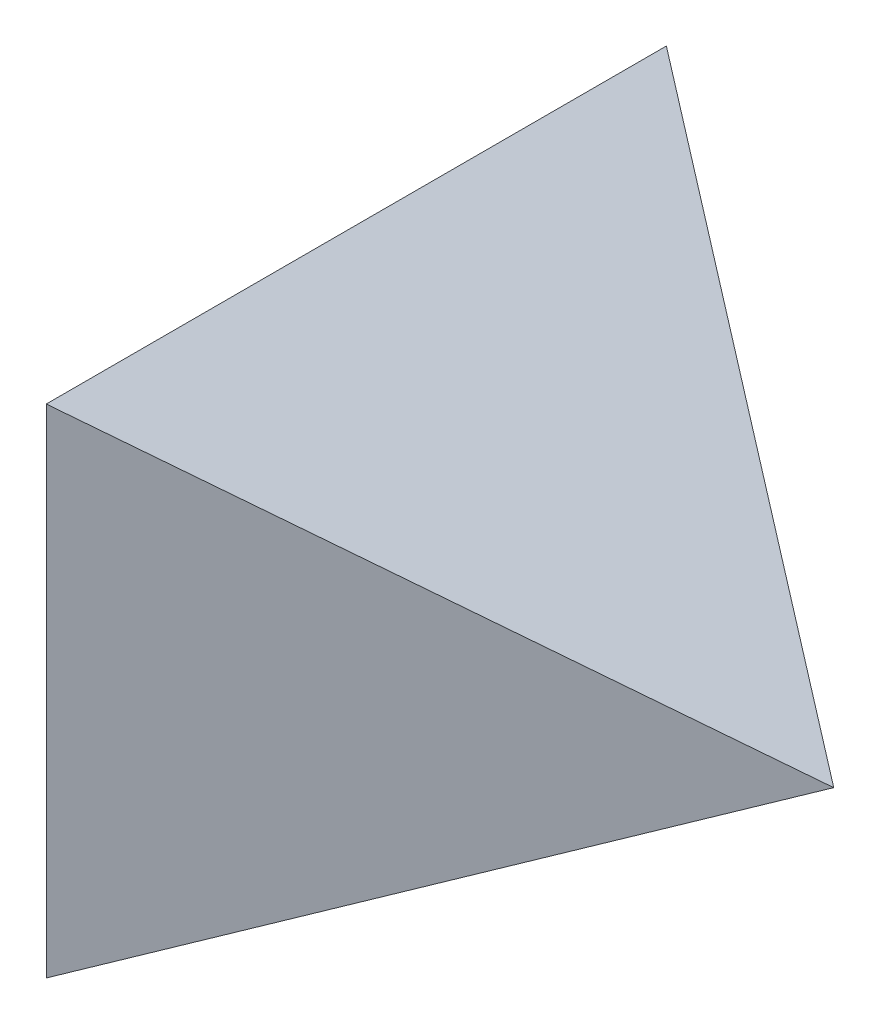
ISO-10303-21;
HEADER;
FILE_DESCRIPTION(('STEP AP214'),'2;1');
FILE_NAME('part.step','',(''),(''),'','','');
FILE_SCHEMA(('AUTOMOTIVE_DESIGN { 1 0 10303 214 1 1 1 1 }'));
ENDSEC;
DATA;
#1=APPLICATION_CONTEXT('core data for automotive mechanical design processes');
#2=APPLICATION_PROTOCOL_DEFINITION('international standard','automotive_design',2000,#1);
#3=PRODUCT_CONTEXT('',#1,'mechanical');
#4=PRODUCT('Part','Part','',(#3));
#5=PRODUCT_RELATED_PRODUCT_CATEGORY('part','',(#4));
#6=PRODUCT_DEFINITION_FORMATION('','',#4);
#7=PRODUCT_DEFINITION_CONTEXT('part definition',#1,'design');
#8=PRODUCT_DEFINITION('design','',#6,#7);
#9=PRODUCT_DEFINITION_SHAPE('','',#8);
#10=(LENGTH_UNIT() NAMED_UNIT(*) SI_UNIT(.MILLI.,.METRE.));
#11=(NAMED_UNIT(*) PLANE_ANGLE_UNIT() SI_UNIT($,.RADIAN.));
#12=(NAMED_UNIT(*) SI_UNIT($,.STERADIAN.) SOLID_ANGLE_UNIT());
#13=UNCERTAINTY_MEASURE_WITH_UNIT(LENGTH_MEASURE(1.E-05),#10,'distance_accuracy_value','');
#14=(GEOMETRIC_REPRESENTATION_CONTEXT(3) GLOBAL_UNCERTAINTY_ASSIGNED_CONTEXT((#13)) GLOBAL_UNIT_ASSIGNED_CONTEXT((#10,
#11,#12)) REPRESENTATION_CONTEXT('',''));
#15=CARTESIAN_POINT('',(0.,0.,0.));
#16=DIRECTION('',(0.,0.,1.));
#17=DIRECTION('',(1.,0.,0.));
#18=AXIS2_PLACEMENT_3D('',#15,#16,#17);
#19=CARTESIAN_POINT('',(0.,0.,-3000.));
#20=DIRECTION('',(0.461748613235035,-0.887010833178221,0.));
#21=DIRECTION('',(0.887010833178221,0.461748613235035,0.));
#22=AXIS2_PLACEMENT_3D('',#19,#20,#21);
#23=PLANE('',#22);
#24=DIRECTION('',(0.768612426799949,0.40011430403667,-0.49914274618985));
#25=VECTOR('',#24,1.);
#26=CARTESIAN_POINT('',(1150.94195240571,599.142457520112,-747.430443221833));
#27=LINE('',#26,#25);
#28=CARTESIAN_POINT('',(-3000.,-1561.70115165524,1948.22277959252));
#29=VERTEX_POINT('',#28);
#30=CARTESIAN_POINT('',(1.11022302462516E-13,2.22044604925031E-13,0.));
#31=VERTEX_POINT('',#30);
#32=EDGE_CURVE('E53',#29,#31,#27,.T.);
#33=ORIENTED_EDGE('',*,*,#32,.F.);
#34=DIRECTION('',(0.,0.,1.));
#35=VECTOR('',#34,1.);
#36=CARTESIAN_POINT('',(-3000.,-1561.70115165524,-3000.));
#37=LINE('',#36,#35);
#38=CARTESIAN_POINT('',(-3000.,-1561.70115165524,-1948.22277959252));
#39=VERTEX_POINT('',#38);
#40=EDGE_CURVE('E72',#39,#29,#37,.T.);
#41=ORIENTED_EDGE('',*,*,#40,.F.);
#42=DIRECTION('',(-0.768612426799948,-0.40011430403667,-0.49914274618985));
#43=VECTOR('',#42,1.);
#44=CARTESIAN_POINT('',(-1150.94195240571,-599.142457520112,-747.430443221835));
#45=LINE('',#44,#43);
#46=EDGE_CURVE('E77',#31,#39,#45,.T.);
#47=ORIENTED_EDGE('',*,*,#46,.F.);
#48=EDGE_LOOP('',(#33,#41,#47));
#49=FACE_BOUND('',#48,.T.);
#50=ADVANCED_FACE('F32',(#49),#23,.T.);
#51=CARTESIAN_POINT('',(-3000.,1561.70115165524,-3000.));
#52=DIRECTION('',(-1.,0.,0.));
#53=DIRECTION('',(0.,0.,1.));
#54=AXIS2_PLACEMENT_3D('',#51,#52,#53);
#55=PLANE('',#54);
#56=DIRECTION('',(0.,-1.,0.));
#57=VECTOR('',#56,1.);
#58=CARTESIAN_POINT('',(-3000.,3000.,1948.22277959252));
#59=LINE('',#58,#57);
#60=CARTESIAN_POINT('',(-3000.,1561.70115165524,1948.22277959252));
#61=VERTEX_POINT('',#60);
#62=EDGE_CURVE('E62',#61,#29,#59,.T.);
#63=ORIENTED_EDGE('',*,*,#62,.F.);
#64=DIRECTION('',(0.,0.,1.));
#65=VECTOR('',#64,1.);
#66=CARTESIAN_POINT('',(-3000.,1561.70115165524,-3000.));
#67=LINE('',#66,#65);
#68=CARTESIAN_POINT('',(-3000.,1561.70115165524,-1948.22277959252));
#69=VERTEX_POINT('',#68);
#70=EDGE_CURVE('E70',#69,#61,#67,.T.);
#71=ORIENTED_EDGE('',*,*,#70,.F.);
#72=DIRECTION('',(0.,-1.,0.));
#73=VECTOR('',#72,1.);
#74=CARTESIAN_POINT('',(-3000.,3000.,-1948.22277959252));
#75=LINE('',#74,#73);
#76=EDGE_CURVE('E46',#69,#39,#75,.T.);
#77=ORIENTED_EDGE('',*,*,#76,.T.);
#78=ORIENTED_EDGE('',*,*,#40,.T.);
#79=EDGE_LOOP('',(#63,#71,#77,#78));
#80=FACE_BOUND('',#79,.T.);
#81=ADVANCED_FACE('F69',(#80),#55,.T.);
#82=CARTESIAN_POINT('',(0.,0.,-3000.));
#83=DIRECTION('',(0.461748613235035,0.887010833178221,0.));
#84=DIRECTION('',(-0.887010833178221,0.461748613235035,0.));
#85=AXIS2_PLACEMENT_3D('',#82,#83,#84);
#86=PLANE('',#85);
#87=DIRECTION('',(-0.768612426799949,0.40011430403667,0.49914274618985));
#88=VECTOR('',#87,1.);
#89=CARTESIAN_POINT('',(1150.94195240571,-599.142457520112,-747.430443221833));
#90=LINE('',#89,#88);
#91=EDGE_CURVE('E12',#31,#61,#90,.T.);
#92=ORIENTED_EDGE('',*,*,#91,.F.);
#93=DIRECTION('',(0.768612426799949,-0.40011430403667,0.49914274618985));
#94=VECTOR('',#93,1.);
#95=CARTESIAN_POINT('',(-1150.94195240571,599.142457520112,-747.430443221835));
#96=LINE('',#95,#94);
#97=EDGE_CURVE('E39',#69,#31,#96,.T.);
#98=ORIENTED_EDGE('',*,*,#97,.F.);
#99=ORIENTED_EDGE('',*,*,#70,.T.);
#100=EDGE_LOOP('',(#92,#98,#99));
#101=FACE_BOUND('',#100,.T.);
#102=ADVANCED_FACE('F74',(#101),#86,.T.);
#103=CARTESIAN_POINT('',(0.,3000.,0.));
#104=DIRECTION('',(-0.544639035015025,0.,0.838670567945425));
#105=DIRECTION('',(0.838670567945425,0.,0.544639035015025));
#106=AXIS2_PLACEMENT_3D('',#103,#104,#105);
#107=PLANE('',#106);
#108=ORIENTED_EDGE('',*,*,#46,.T.);
#109=ORIENTED_EDGE('',*,*,#76,.F.);
#110=ORIENTED_EDGE('',*,*,#97,.T.);
#111=EDGE_LOOP('',(#108,#109,#110));
#112=FACE_BOUND('',#111,.T.);
#113=ADVANCED_FACE('F79',(#112),#107,.F.);
#114=CARTESIAN_POINT('',(-3000.,3000.,1948.22277959252));
#115=DIRECTION('',(-0.544639035015025,0.,-0.838670567945425));
#116=DIRECTION('',(-0.838670567945425,0.,0.544639035015025));
#117=AXIS2_PLACEMENT_3D('',#114,#115,#116);
#118=PLANE('',#117);
#119=ORIENTED_EDGE('',*,*,#32,.T.);
#120=ORIENTED_EDGE('',*,*,#91,.T.);
#121=ORIENTED_EDGE('',*,*,#62,.T.);
#122=EDGE_LOOP('',(#119,#120,#121));
#123=FACE_BOUND('',#122,.T.);
#124=ADVANCED_FACE('F61',(#123),#118,.F.);
#125=CLOSED_SHELL('',(#50,#81,#102,#113,#124));
#126=MANIFOLD_SOLID_BREP('B2',#125);
#127=ADVANCED_BREP_SHAPE_REPRESENTATION('',(#18,#126),#14);
#128=SHAPE_DEFINITION_REPRESENTATION(#9,#127);
ENDSEC;
END-ISO-10303-21;
